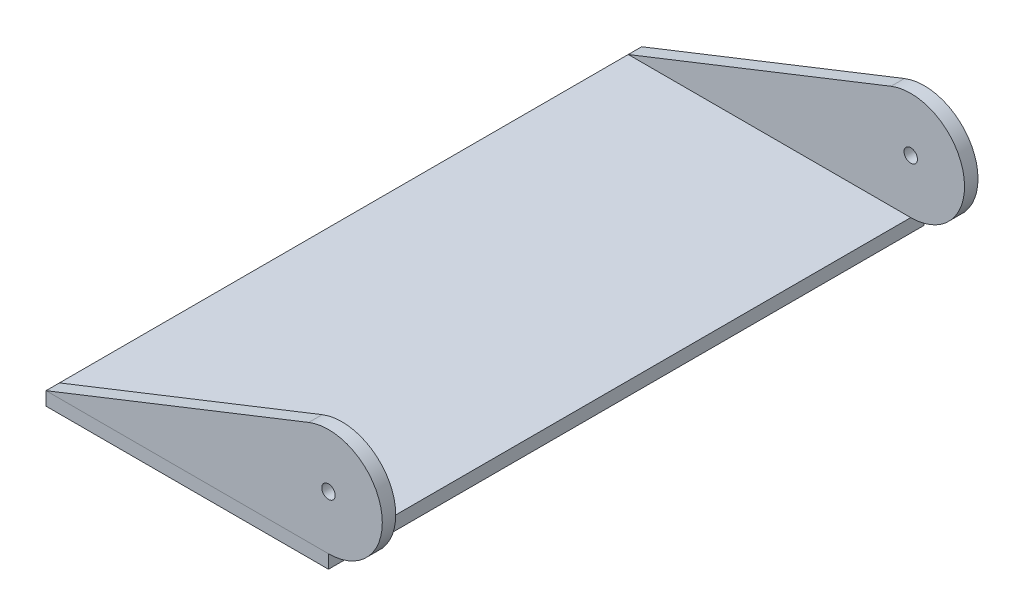
ISO-10303-21;
HEADER;
FILE_DESCRIPTION(('STEP AP214'),'2;1');
FILE_NAME('part.step','',(''),(''),'','','');
FILE_SCHEMA(('AUTOMOTIVE_DESIGN { 1 0 10303 214 1 1 1 1 }'));
ENDSEC;
DATA;
#1=APPLICATION_CONTEXT('core data for automotive mechanical design processes');
#2=APPLICATION_PROTOCOL_DEFINITION('international standard','automotive_design',2000,#1);
#3=PRODUCT_CONTEXT('',#1,'mechanical');
#4=PRODUCT('Part','Part','',(#3));
#5=PRODUCT_RELATED_PRODUCT_CATEGORY('part','',(#4));
#6=PRODUCT_DEFINITION_FORMATION('','',#4);
#7=PRODUCT_DEFINITION_CONTEXT('part definition',#1,'design');
#8=PRODUCT_DEFINITION('design','',#6,#7);
#9=PRODUCT_DEFINITION_SHAPE('','',#8);
#10=(LENGTH_UNIT() NAMED_UNIT(*) SI_UNIT(.MILLI.,.METRE.));
#11=(NAMED_UNIT(*) PLANE_ANGLE_UNIT() SI_UNIT($,.RADIAN.));
#12=(NAMED_UNIT(*) SI_UNIT($,.STERADIAN.) SOLID_ANGLE_UNIT());
#13=UNCERTAINTY_MEASURE_WITH_UNIT(LENGTH_MEASURE(1.E-05),#10,'distance_accuracy_value','');
#14=(GEOMETRIC_REPRESENTATION_CONTEXT(3) GLOBAL_UNCERTAINTY_ASSIGNED_CONTEXT((#13)) GLOBAL_UNIT_ASSIGNED_CONTEXT((#10,
#11,#12)) REPRESENTATION_CONTEXT('',''));
#15=CARTESIAN_POINT('',(0.,0.,0.));
#16=DIRECTION('',(0.,0.,1.));
#17=DIRECTION('',(1.,0.,0.));
#18=AXIS2_PLACEMENT_3D('',#15,#16,#17);
#19=CARTESIAN_POINT('',(0.,1.5875,-42.1947603330405));
#20=DIRECTION('',(0.,1.,0.));
#21=DIRECTION('',(0.,0.,1.));
#22=AXIS2_PLACEMENT_3D('',#19,#20,#21);
#23=PLANE('',#22);
#24=DIRECTION('',(0.,0.,1.));
#25=VECTOR('',#24,1.);
#26=CARTESIAN_POINT('',(32.9217251712329,1.5875,-42.1947603330405));
#27=LINE('',#26,#25);
#28=CARTESIAN_POINT('',(32.9217251712329,1.5875,-0.524775256849318));
#29=VERTEX_POINT('',#28);
#30=CARTESIAN_POINT('',(32.9217251712329,1.5875,1.06272474315068));
#31=VERTEX_POINT('',#30);
#32=EDGE_CURVE('E49',#29,#31,#27,.T.);
#33=ORIENTED_EDGE('',*,*,#32,.T.);
#34=DIRECTION('',(-1.,0.,0.));
#35=VECTOR('',#34,1.);
#36=CARTESIAN_POINT('',(39.2717251712329,1.5875,1.06272474315068));
#37=LINE('',#36,#35);
#38=CARTESIAN_POINT('',(-0.415774828767123,1.5875,1.06272474315068));
#39=VERTEX_POINT('',#38);
#40=EDGE_CURVE('E96',#31,#39,#37,.T.);
#41=ORIENTED_EDGE('',*,*,#40,.T.);
#42=DIRECTION('',(0.,0.,1.));
#43=VECTOR('',#42,1.);
#44=CARTESIAN_POINT('',(-0.415774828767123,1.5875,-42.1947603330405));
#45=LINE('',#44,#43);
#46=CARTESIAN_POINT('',(-0.415774828767123,1.5875,-0.524775256849318));
#47=VERTEX_POINT('',#46);
#48=EDGE_CURVE('E92',#47,#39,#45,.T.);
#49=ORIENTED_EDGE('',*,*,#48,.F.);
#50=DIRECTION('',(-1.,0.,0.));
#51=VECTOR('',#50,1.);
#52=CARTESIAN_POINT('',(0.,1.5875,-0.524775256849318));
#53=LINE('',#52,#51);
#54=EDGE_CURVE('E80',#29,#47,#53,.T.);
#55=ORIENTED_EDGE('',*,*,#54,.F.);
#56=EDGE_LOOP('',(#33,#41,#49,#55));
#57=FACE_BOUND('',#56,.T.);
#58=ADVANCED_FACE('F45',(#57),#23,.F.);
#59=CARTESIAN_POINT('',(-0.59891274924526,1.51510665731688,-42.1947603330405));
#60=DIRECTION('',(0.367614879649891,-0.929978118161926,0.));
#61=DIRECTION('',(0.929978118161926,0.367614879649891,0.));
#62=AXIS2_PLACEMENT_3D('',#59,#60,#61);
#63=PLANE('',#62);
#64=ORIENTED_EDGE('',*,*,#48,.T.);
#65=DIRECTION('',(0.929978118161926,0.367614879649891,0.));
#66=VECTOR('',#65,1.);
#67=CARTESIAN_POINT('',(-0.598912749245261,1.51510665731688,1.06272474315068));
#68=LINE('',#67,#66);
#69=CARTESIAN_POINT('',(30.5873706854561,13.8428610503282,1.06272474315068));
#70=VERTEX_POINT('',#69);
#71=EDGE_CURVE('E61',#39,#70,#68,.T.);
#72=ORIENTED_EDGE('',*,*,#71,.T.);
#73=DIRECTION('',(0.,0.,1.));
#74=VECTOR('',#73,1.);
#75=CARTESIAN_POINT('',(30.5873706854561,13.8428610503282,-42.1947603330405));
#76=LINE('',#75,#74);
#77=CARTESIAN_POINT('',(30.5873706854561,13.8428610503282,-0.524775256849318));
#78=VERTEX_POINT('',#77);
#79=EDGE_CURVE('E87',#78,#70,#76,.T.);
#80=ORIENTED_EDGE('',*,*,#79,.F.);
#81=DIRECTION('',(0.929978118161926,0.367614879649891,0.));
#82=VECTOR('',#81,1.);
#83=CARTESIAN_POINT('',(-0.59891274924526,1.51510665731688,-0.524775256849318));
#84=LINE('',#83,#82);
#85=EDGE_CURVE('E54',#47,#78,#84,.T.);
#86=ORIENTED_EDGE('',*,*,#85,.F.);
#87=EDGE_LOOP('',(#64,#72,#80,#86));
#88=FACE_BOUND('',#87,.T.);
#89=ADVANCED_FACE('F109',(#88),#63,.F.);
#90=CARTESIAN_POINT('',(32.9217251712329,7.9375,-42.1947603330405));
#91=DIRECTION('',(0.,0.,1.));
#92=DIRECTION('',(1.,0.,0.));
#93=AXIS2_PLACEMENT_3D('',#90,#91,#92);
#94=CYLINDRICAL_SURFACE('',#93,6.35);
#95=CARTESIAN_POINT('',(32.9217251712329,7.9375,1.06272474315068));
#96=DIRECTION('',(0.,0.,-1.));
#97=DIRECTION('',(0.,1.,0.));
#98=AXIS2_PLACEMENT_3D('',#95,#96,#97);
#99=CIRCLE('',#98,6.35);
#100=EDGE_CURVE('E12',#31,#70,#99,.F.);
#101=ORIENTED_EDGE('',*,*,#100,.F.);
#102=ORIENTED_EDGE('',*,*,#32,.F.);
#103=CARTESIAN_POINT('',(32.9217251712329,7.9375,-0.524775256849318));
#104=DIRECTION('',(0.,0.,-1.));
#105=DIRECTION('',(-1.,0.,0.));
#106=AXIS2_PLACEMENT_3D('',#103,#104,#105);
#107=CIRCLE('',#106,6.35);
#108=EDGE_CURVE('E77',#29,#78,#107,.F.);
#109=ORIENTED_EDGE('',*,*,#108,.T.);
#110=ORIENTED_EDGE('',*,*,#79,.T.);
#111=EDGE_LOOP('',(#101,#102,#109,#110));
#112=FACE_BOUND('',#111,.T.);
#113=ADVANCED_FACE('F95',(#112),#94,.T.);
#114=CARTESIAN_POINT('',(32.9217251712329,7.9375,-42.1947603330405));
#115=DIRECTION('',(0.,0.,1.));
#116=DIRECTION('',(1.,0.,0.));
#117=AXIS2_PLACEMENT_3D('',#114,#115,#116);
#118=CYLINDRICAL_SURFACE('',#117,0.79375);
#119=CARTESIAN_POINT('',(32.9217251712329,7.9375,1.06272474315068));
#120=DIRECTION('',(0.,0.,-1.));
#121=DIRECTION('',(0.,1.,0.));
#122=AXIS2_PLACEMENT_3D('',#119,#120,#121);
#123=CIRCLE('',#122,0.79375);
#124=CARTESIAN_POINT('',(32.9217251712329,8.73125,1.06272474315068));
#125=VERTEX_POINT('',#124);
#126=EDGE_CURVE('E100',#125,#125,#123,.F.);
#127=ORIENTED_EDGE('',*,*,#126,.T.);
#128=EDGE_LOOP('',(#127));
#129=FACE_BOUND('',#128,.T.);
#130=CARTESIAN_POINT('',(32.9217251712329,7.9375,-0.524775256849318));
#131=DIRECTION('',(0.,0.,-1.));
#132=DIRECTION('',(-1.,0.,0.));
#133=AXIS2_PLACEMENT_3D('',#130,#131,#132);
#134=CIRCLE('',#133,0.79375);
#135=CARTESIAN_POINT('',(32.1279751712329,7.9375,-0.524775256849318));
#136=VERTEX_POINT('',#135);
#137=EDGE_CURVE('E93',#136,#136,#134,.F.);
#138=ORIENTED_EDGE('',*,*,#137,.F.);
#139=EDGE_LOOP('',(#138));
#140=FACE_BOUND('',#139,.T.);
#141=ADVANCED_FACE('F47',(#129,#140),#118,.F.);
#142=CARTESIAN_POINT('',(-0.415774828767123,1.5875,-0.524775256849315));
#143=DIRECTION('',(0.,0.,-1.));
#144=DIRECTION('',(-1.,0.,0.));
#145=AXIS2_PLACEMENT_3D('',#142,#143,#144);
#146=PLANE('',#145);
#147=ORIENTED_EDGE('',*,*,#137,.T.);
#148=EDGE_LOOP('',(#147));
#149=FACE_BOUND('',#148,.T.);
#150=ORIENTED_EDGE('',*,*,#108,.F.);
#151=ORIENTED_EDGE('',*,*,#54,.T.);
#152=ORIENTED_EDGE('',*,*,#85,.T.);
#153=EDGE_LOOP('',(#150,#151,#152));
#154=FACE_BOUND('',#153,.T.);
#155=ADVANCED_FACE('F79',(#149,#154),#146,.T.);
#156=CARTESIAN_POINT('',(39.2717251712329,1.5875,1.06272474315068));
#157=DIRECTION('',(0.,0.,-1.));
#158=DIRECTION('',(0.,1.,0.));
#159=AXIS2_PLACEMENT_3D('',#156,#157,#158);
#160=PLANE('',#159);
#161=ORIENTED_EDGE('',*,*,#126,.F.);
#162=EDGE_LOOP('',(#161));
#163=FACE_BOUND('',#162,.T.);
#164=ORIENTED_EDGE('',*,*,#40,.F.);
#165=ORIENTED_EDGE('',*,*,#100,.T.);
#166=ORIENTED_EDGE('',*,*,#71,.F.);
#167=EDGE_LOOP('',(#164,#165,#166));
#168=FACE_BOUND('',#167,.T.);
#169=ADVANCED_FACE('F118',(#163,#168),#160,.F.);
#170=CLOSED_SHELL('',(#58,#89,#113,#141,#155,#169));
#171=MANIFOLD_SOLID_BREP('B2',#170);
#172=CARTESIAN_POINT('',(32.9217251712329,7.9375,-42.1947603330405));
#173=DIRECTION('',(0.,0.,1.));
#174=DIRECTION('',(1.,0.,0.));
#175=AXIS2_PLACEMENT_3D('',#172,#173,#174);
#176=CYLINDRICAL_SURFACE('',#175,6.35);
#177=CARTESIAN_POINT('',(32.9217251712329,7.9375,68.1877247431507));
#178=DIRECTION('',(0.,0.,1.));
#179=DIRECTION('',(1.,0.,0.));
#180=AXIS2_PLACEMENT_3D('',#177,#178,#179);
#181=CIRCLE('',#180,6.35);
#182=CARTESIAN_POINT('',(30.5873706854561,13.8428610503282,68.1877247431507));
#183=VERTEX_POINT('',#182);
#184=CARTESIAN_POINT('',(32.9217251712329,1.5875,68.1877247431507));
#185=VERTEX_POINT('',#184);
#186=EDGE_CURVE('E212',#183,#185,#181,.F.);
#187=ORIENTED_EDGE('',*,*,#186,.F.);
#188=DIRECTION('',(0.,0.,1.));
#189=VECTOR('',#188,1.);
#190=CARTESIAN_POINT('',(30.5873706854561,13.8428610503282,-42.1947603330405));
#191=LINE('',#190,#189);
#192=CARTESIAN_POINT('',(30.5873706854561,13.8428610503282,69.7752247431507));
#193=VERTEX_POINT('',#192);
#194=EDGE_CURVE('E193',#183,#193,#191,.T.);
#195=ORIENTED_EDGE('',*,*,#194,.T.);
#196=CARTESIAN_POINT('',(32.9217251712329,7.9375,69.7752247431507));
#197=DIRECTION('',(0.,0.,1.));
#198=DIRECTION('',(1.,0.,0.));
#199=AXIS2_PLACEMENT_3D('',#196,#197,#198);
#200=CIRCLE('',#199,6.35);
#201=CARTESIAN_POINT('',(32.9217251712329,1.5875,69.7752247431507));
#202=VERTEX_POINT('',#201);
#203=EDGE_CURVE('E43',#202,#193,#200,.T.);
#204=ORIENTED_EDGE('',*,*,#203,.F.);
#205=DIRECTION('',(0.,0.,1.));
#206=VECTOR('',#205,1.);
#207=CARTESIAN_POINT('',(32.9217251712329,1.5875,-42.1947603330405));
#208=LINE('',#207,#206);
#209=EDGE_CURVE('E222',#185,#202,#208,.T.);
#210=ORIENTED_EDGE('',*,*,#209,.F.);
#211=EDGE_LOOP('',(#187,#195,#204,#210));
#212=FACE_BOUND('',#211,.T.);
#213=ADVANCED_FACE('F175',(#212),#176,.T.);
#214=CARTESIAN_POINT('',(-0.59891274924526,1.51510665731688,-42.1947603330405));
#215=DIRECTION('',(0.367614879649891,-0.929978118161926,0.));
#216=DIRECTION('',(0.929978118161926,0.367614879649891,0.));
#217=AXIS2_PLACEMENT_3D('',#214,#215,#216);
#218=PLANE('',#217);
#219=ORIENTED_EDGE('',*,*,#194,.F.);
#220=DIRECTION('',(-0.929978118161926,-0.367614879649891,0.));
#221=VECTOR('',#220,1.);
#222=CARTESIAN_POINT('',(-0.59891274924526,1.51510665731688,68.1877247431507));
#223=LINE('',#222,#221);
#224=CARTESIAN_POINT('',(-0.415774828767123,1.5875,68.1877247431507));
#225=VERTEX_POINT('',#224);
#226=EDGE_CURVE('E211',#183,#225,#223,.T.);
#227=ORIENTED_EDGE('',*,*,#226,.T.);
#228=DIRECTION('',(0.,0.,1.));
#229=VECTOR('',#228,1.);
#230=CARTESIAN_POINT('',(-0.415774828767123,1.5875,-42.1947603330405));
#231=LINE('',#230,#229);
#232=CARTESIAN_POINT('',(-0.415774828767123,1.5875,69.7752247431507));
#233=VERTEX_POINT('',#232);
#234=EDGE_CURVE('E220',#225,#233,#231,.T.);
#235=ORIENTED_EDGE('',*,*,#234,.T.);
#236=DIRECTION('',(0.929978118161926,0.367614879649891,0.));
#237=VECTOR('',#236,1.);
#238=CARTESIAN_POINT('',(-0.59891274924526,1.51510665731688,69.7752247431507));
#239=LINE('',#238,#237);
#240=EDGE_CURVE('E228',#233,#193,#239,.T.);
#241=ORIENTED_EDGE('',*,*,#240,.T.);
#242=EDGE_LOOP('',(#219,#227,#235,#241));
#243=FACE_BOUND('',#242,.T.);
#244=ADVANCED_FACE('F219',(#243),#218,.F.);
#245=CARTESIAN_POINT('',(0.,1.5875,-42.1947603330405));
#246=DIRECTION('',(0.,1.,0.));
#247=DIRECTION('',(0.,0.,1.));
#248=AXIS2_PLACEMENT_3D('',#245,#246,#247);
#249=PLANE('',#248);
#250=ORIENTED_EDGE('',*,*,#234,.F.);
#251=DIRECTION('',(-1.,0.,0.));
#252=VECTOR('',#251,1.);
#253=CARTESIAN_POINT('',(39.2717251712329,1.5875,68.1877247431507));
#254=LINE('',#253,#252);
#255=EDGE_CURVE('E208',#185,#225,#254,.T.);
#256=ORIENTED_EDGE('',*,*,#255,.F.);
#257=ORIENTED_EDGE('',*,*,#209,.T.);
#258=DIRECTION('',(-1.,0.,0.));
#259=VECTOR('',#258,1.);
#260=CARTESIAN_POINT('',(0.,1.5875,69.7752247431507));
#261=LINE('',#260,#259);
#262=EDGE_CURVE('E227',#202,#233,#261,.T.);
#263=ORIENTED_EDGE('',*,*,#262,.T.);
#264=EDGE_LOOP('',(#250,#256,#257,#263));
#265=FACE_BOUND('',#264,.T.);
#266=ADVANCED_FACE('F225',(#265),#249,.F.);
#267=CARTESIAN_POINT('',(0.,0.,69.7752247431507));
#268=DIRECTION('',(0.,0.,1.));
#269=DIRECTION('',(1.,0.,0.));
#270=AXIS2_PLACEMENT_3D('',#267,#268,#269);
#271=PLANE('',#270);
#272=ORIENTED_EDGE('',*,*,#262,.F.);
#273=ORIENTED_EDGE('',*,*,#203,.T.);
#274=ORIENTED_EDGE('',*,*,#240,.F.);
#275=EDGE_LOOP('',(#272,#273,#274));
#276=FACE_BOUND('',#275,.T.);
#277=CARTESIAN_POINT('',(32.9217251712329,7.9375,69.7752247431507));
#278=DIRECTION('',(0.,0.,1.));
#279=DIRECTION('',(1.,0.,0.));
#280=AXIS2_PLACEMENT_3D('',#277,#278,#279);
#281=CIRCLE('',#280,0.79375);
#282=CARTESIAN_POINT('',(33.7154751712329,7.9375,69.7752247431507));
#283=VERTEX_POINT('',#282);
#284=EDGE_CURVE('E185',#283,#283,#281,.T.);
#285=ORIENTED_EDGE('',*,*,#284,.F.);
#286=EDGE_LOOP('',(#285));
#287=FACE_BOUND('',#286,.T.);
#288=ADVANCED_FACE('F234',(#276,#287),#271,.T.);
#289=CARTESIAN_POINT('',(32.9217251712329,7.9375,-42.1947603330405));
#290=DIRECTION('',(0.,0.,1.));
#291=DIRECTION('',(1.,0.,0.));
#292=AXIS2_PLACEMENT_3D('',#289,#290,#291);
#293=CYLINDRICAL_SURFACE('',#292,0.79375);
#294=CARTESIAN_POINT('',(32.9217251712329,7.9375,68.1877247431507));
#295=DIRECTION('',(0.,0.,1.));
#296=DIRECTION('',(1.,0.,0.));
#297=AXIS2_PLACEMENT_3D('',#294,#295,#296);
#298=CIRCLE('',#297,0.79375);
#299=CARTESIAN_POINT('',(33.7154751712329,7.9375,68.1877247431507));
#300=VERTEX_POINT('',#299);
#301=EDGE_CURVE('E179',#300,#300,#298,.F.);
#302=ORIENTED_EDGE('',*,*,#301,.T.);
#303=EDGE_LOOP('',(#302));
#304=FACE_BOUND('',#303,.T.);
#305=ORIENTED_EDGE('',*,*,#284,.T.);
#306=EDGE_LOOP('',(#305));
#307=FACE_BOUND('',#306,.T.);
#308=ADVANCED_FACE('F177',(#304,#307),#293,.F.);
#309=CARTESIAN_POINT('',(39.2717251712329,1.5875,68.1877247431507));
#310=DIRECTION('',(0.,0.,1.));
#311=DIRECTION('',(1.,0.,0.));
#312=AXIS2_PLACEMENT_3D('',#309,#310,#311);
#313=PLANE('',#312);
#314=ORIENTED_EDGE('',*,*,#301,.F.);
#315=EDGE_LOOP('',(#314));
#316=FACE_BOUND('',#315,.T.);
#317=ORIENTED_EDGE('',*,*,#226,.F.);
#318=ORIENTED_EDGE('',*,*,#186,.T.);
#319=ORIENTED_EDGE('',*,*,#255,.T.);
#320=EDGE_LOOP('',(#317,#318,#319));
#321=FACE_BOUND('',#320,.T.);
#322=ADVANCED_FACE('F210',(#316,#321),#313,.F.);
#323=CLOSED_SHELL('',(#213,#244,#266,#288,#308,#322));
#324=MANIFOLD_SOLID_BREP('B6',#323);
#325=CARTESIAN_POINT('',(-0.415774828767123,1.5875,69.7752247431507));
#326=DIRECTION('',(-1.,0.,0.));
#327=DIRECTION('',(0.,0.,1.));
#328=AXIS2_PLACEMENT_3D('',#325,#326,#327);
#329=PLANE('',#328);
#330=DIRECTION('',(0.,0.,-1.));
#331=VECTOR('',#330,1.);
#332=CARTESIAN_POINT('',(-0.415774828767123,0.,69.7752247431507));
#333=LINE('',#332,#331);
#334=CARTESIAN_POINT('',(-0.415774828767123,0.,69.7752247431507));
#335=VERTEX_POINT('',#334);
#336=CARTESIAN_POINT('',(-0.415774828767123,0.,-0.524775256849315));
#337=VERTEX_POINT('',#336);
#338=EDGE_CURVE('E364',#335,#337,#333,.T.);
#339=ORIENTED_EDGE('',*,*,#338,.F.);
#340=DIRECTION('',(0.,-1.,0.));
#341=VECTOR('',#340,1.);
#342=CARTESIAN_POINT('',(-0.415774828767123,1.5875,69.7752247431507));
#343=LINE('',#342,#341);
#344=CARTESIAN_POINT('',(-0.415774828767123,1.5875,69.7752247431507));
#345=VERTEX_POINT('',#344);
#346=EDGE_CURVE('E173',#345,#335,#343,.T.);
#347=ORIENTED_EDGE('',*,*,#346,.F.);
#348=DIRECTION('',(0.,0.,-1.));
#349=VECTOR('',#348,1.);
#350=CARTESIAN_POINT('',(-0.415774828767123,1.5875,69.7752247431507));
#351=LINE('',#350,#349);
#352=CARTESIAN_POINT('',(-0.415774828767123,1.5875,-0.524775256849315));
#353=VERTEX_POINT('',#352);
#354=EDGE_CURVE('E359',#345,#353,#351,.T.);
#355=ORIENTED_EDGE('',*,*,#354,.T.);
#356=DIRECTION('',(0.,-1.,0.));
#357=VECTOR('',#356,1.);
#358=CARTESIAN_POINT('',(-0.415774828767123,1.5875,-0.524775256849315));
#359=LINE('',#358,#357);
#360=EDGE_CURVE('E302',#353,#337,#359,.T.);
#361=ORIENTED_EDGE('',*,*,#360,.T.);
#362=EDGE_LOOP('',(#339,#347,#355,#361));
#363=FACE_BOUND('',#362,.T.);
#364=ADVANCED_FACE('F299',(#363),#329,.T.);
#365=CARTESIAN_POINT('',(-0.415774828767123,1.5875,69.7752247431507));
#366=DIRECTION('',(0.,0.,-1.));
#367=DIRECTION('',(-1.,0.,0.));
#368=AXIS2_PLACEMENT_3D('',#365,#366,#367);
#369=PLANE('',#368);
#370=DIRECTION('',(1.,0.,0.));
#371=VECTOR('',#370,1.);
#372=CARTESIAN_POINT('',(-0.415774828767123,0.,69.7752247431507));
#373=LINE('',#372,#371);
#374=CARTESIAN_POINT('',(32.9217251712329,0.,69.7752247431507));
#375=VERTEX_POINT('',#374);
#376=EDGE_CURVE('E332',#335,#375,#373,.T.);
#377=ORIENTED_EDGE('',*,*,#376,.T.);
#378=DIRECTION('',(0.,-1.,0.));
#379=VECTOR('',#378,1.);
#380=CARTESIAN_POINT('',(32.9217251712329,1.5875,69.7752247431507));
#381=LINE('',#380,#379);
#382=CARTESIAN_POINT('',(32.9217251712329,1.5875,69.7752247431507));
#383=VERTEX_POINT('',#382);
#384=EDGE_CURVE('E308',#383,#375,#381,.T.);
#385=ORIENTED_EDGE('',*,*,#384,.F.);
#386=DIRECTION('',(1.,0.,0.));
#387=VECTOR('',#386,1.);
#388=CARTESIAN_POINT('',(-0.415774828767123,1.5875,69.7752247431507));
#389=LINE('',#388,#387);
#390=EDGE_CURVE('E349',#345,#383,#389,.T.);
#391=ORIENTED_EDGE('',*,*,#390,.F.);
#392=ORIENTED_EDGE('',*,*,#346,.T.);
#393=EDGE_LOOP('',(#377,#385,#391,#392));
#394=FACE_BOUND('',#393,.T.);
#395=ADVANCED_FACE('F374',(#394),#369,.F.);
#396=CARTESIAN_POINT('',(32.9217251712329,1.5875,69.7752247431507));
#397=DIRECTION('',(-1.,0.,0.));
#398=DIRECTION('',(0.,0.,1.));
#399=AXIS2_PLACEMENT_3D('',#396,#397,#398);
#400=PLANE('',#399);
#401=DIRECTION('',(0.,0.,-1.));
#402=VECTOR('',#401,1.);
#403=CARTESIAN_POINT('',(32.9217251712329,0.,69.7752247431507));
#404=LINE('',#403,#402);
#405=CARTESIAN_POINT('',(32.9217251712329,0.,-0.524775256849315));
#406=VERTEX_POINT('',#405);
#407=EDGE_CURVE('E356',#375,#406,#404,.T.);
#408=ORIENTED_EDGE('',*,*,#407,.T.);
#409=DIRECTION('',(0.,-1.,0.));
#410=VECTOR('',#409,1.);
#411=CARTESIAN_POINT('',(32.9217251712329,1.5875,-0.524775256849315));
#412=LINE('',#411,#410);
#413=CARTESIAN_POINT('',(32.9217251712329,1.5875,-0.524775256849315));
#414=VERTEX_POINT('',#413);
#415=EDGE_CURVE('E353',#414,#406,#412,.T.);
#416=ORIENTED_EDGE('',*,*,#415,.F.);
#417=DIRECTION('',(0.,0.,-1.));
#418=VECTOR('',#417,1.);
#419=CARTESIAN_POINT('',(32.9217251712329,1.5875,69.7752247431507));
#420=LINE('',#419,#418);
#421=EDGE_CURVE('E344',#383,#414,#420,.T.);
#422=ORIENTED_EDGE('',*,*,#421,.F.);
#423=ORIENTED_EDGE('',*,*,#384,.T.);
#424=EDGE_LOOP('',(#408,#416,#422,#423));
#425=FACE_BOUND('',#424,.T.);
#426=ADVANCED_FACE('F354',(#425),#400,.F.);
#427=CARTESIAN_POINT('',(-0.415774828767123,1.5875,-0.524775256849315));
#428=DIRECTION('',(0.,0.,-1.));
#429=DIRECTION('',(-1.,0.,0.));
#430=AXIS2_PLACEMENT_3D('',#427,#428,#429);
#431=PLANE('',#430);
#432=DIRECTION('',(1.,0.,0.));
#433=VECTOR('',#432,1.);
#434=CARTESIAN_POINT('',(-0.415774828767123,0.,-0.524775256849315));
#435=LINE('',#434,#433);
#436=EDGE_CURVE('E367',#337,#406,#435,.T.);
#437=ORIENTED_EDGE('',*,*,#436,.F.);
#438=ORIENTED_EDGE('',*,*,#360,.F.);
#439=DIRECTION('',(1.,0.,0.));
#440=VECTOR('',#439,1.);
#441=CARTESIAN_POINT('',(-0.415774828767123,1.5875,-0.524775256849315));
#442=LINE('',#441,#440);
#443=EDGE_CURVE('E348',#353,#414,#442,.T.);
#444=ORIENTED_EDGE('',*,*,#443,.T.);
#445=ORIENTED_EDGE('',*,*,#415,.T.);
#446=EDGE_LOOP('',(#437,#438,#444,#445));
#447=FACE_BOUND('',#446,.T.);
#448=ADVANCED_FACE('F358',(#447),#431,.T.);
#449=CARTESIAN_POINT('',(0.,1.5875,0.));
#450=DIRECTION('',(0.,-1.,0.));
#451=DIRECTION('',(0.,0.,-1.));
#452=AXIS2_PLACEMENT_3D('',#449,#450,#451);
#453=PLANE('',#452);
#454=ORIENTED_EDGE('',*,*,#354,.F.);
#455=ORIENTED_EDGE('',*,*,#390,.T.);
#456=ORIENTED_EDGE('',*,*,#421,.T.);
#457=ORIENTED_EDGE('',*,*,#443,.F.);
#458=EDGE_LOOP('',(#454,#455,#456,#457));
#459=FACE_BOUND('',#458,.T.);
#460=ADVANCED_FACE('F347',(#459),#453,.F.);
#461=CARTESIAN_POINT('',(0.,0.,0.));
#462=DIRECTION('',(0.,-1.,0.));
#463=DIRECTION('',(0.,0.,-1.));
#464=AXIS2_PLACEMENT_3D('',#461,#462,#463);
#465=PLANE('',#464);
#466=ORIENTED_EDGE('',*,*,#338,.T.);
#467=ORIENTED_EDGE('',*,*,#436,.T.);
#468=ORIENTED_EDGE('',*,*,#407,.F.);
#469=ORIENTED_EDGE('',*,*,#376,.F.);
#470=EDGE_LOOP('',(#466,#467,#468,#469));
#471=FACE_BOUND('',#470,.T.);
#472=ADVANCED_FACE('F372',(#471),#465,.T.);
#473=CLOSED_SHELL('',(#364,#395,#426,#448,#460,#472));
#474=MANIFOLD_SOLID_BREP('B37',#473);
#475=ADVANCED_BREP_SHAPE_REPRESENTATION('',(#18,#171,#324,#474),#14);
#476=SHAPE_DEFINITION_REPRESENTATION(#9,#475);
ENDSEC;
END-ISO-10303-21;
